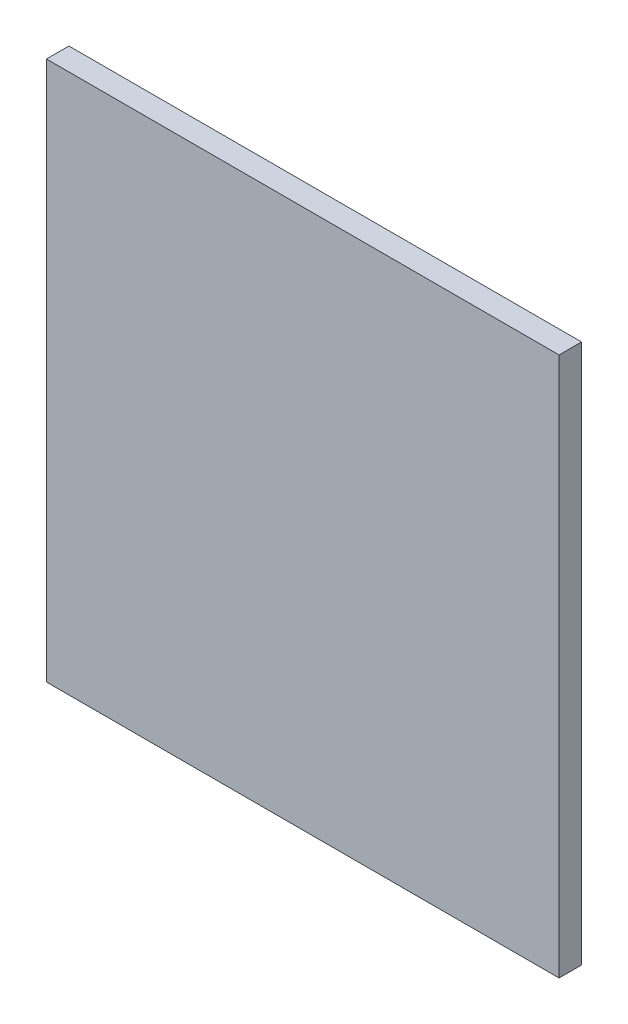
ISO-10303-21;
HEADER;
FILE_DESCRIPTION(('STEP AP214'),'2;1');
FILE_NAME('part.step','',(''),(''),'','','');
FILE_SCHEMA(('AUTOMOTIVE_DESIGN { 1 0 10303 214 1 1 1 1 }'));
ENDSEC;
DATA;
#1=APPLICATION_CONTEXT('core data for automotive mechanical design processes');
#2=APPLICATION_PROTOCOL_DEFINITION('international standard','automotive_design',2000,#1);
#3=PRODUCT_CONTEXT('',#1,'mechanical');
#4=PRODUCT('Part','Part','',(#3));
#5=PRODUCT_RELATED_PRODUCT_CATEGORY('part','',(#4));
#6=PRODUCT_DEFINITION_FORMATION('','',#4);
#7=PRODUCT_DEFINITION_CONTEXT('part definition',#1,'design');
#8=PRODUCT_DEFINITION('design','',#6,#7);
#9=PRODUCT_DEFINITION_SHAPE('','',#8);
#10=(LENGTH_UNIT() NAMED_UNIT(*) SI_UNIT(.MILLI.,.METRE.));
#11=(NAMED_UNIT(*) PLANE_ANGLE_UNIT() SI_UNIT($,.RADIAN.));
#12=(NAMED_UNIT(*) SI_UNIT($,.STERADIAN.) SOLID_ANGLE_UNIT());
#13=UNCERTAINTY_MEASURE_WITH_UNIT(LENGTH_MEASURE(1.E-05),#10,'distance_accuracy_value','');
#14=(GEOMETRIC_REPRESENTATION_CONTEXT(3) GLOBAL_UNCERTAINTY_ASSIGNED_CONTEXT((#13)) GLOBAL_UNIT_ASSIGNED_CONTEXT((#10,
#11,#12)) REPRESENTATION_CONTEXT('',''));
#15=CARTESIAN_POINT('',(0.,0.,0.));
#16=DIRECTION('',(0.,0.,1.));
#17=DIRECTION('',(1.,0.,0.));
#18=AXIS2_PLACEMENT_3D('',#15,#16,#17);
#19=CARTESIAN_POINT('',(0.,0.,3.175));
#20=DIRECTION('',(1.,0.,0.));
#21=DIRECTION('',(0.,0.,-1.));
#22=AXIS2_PLACEMENT_3D('',#19,#20,#21);
#23=PLANE('',#22);
#24=DIRECTION('',(0.,-1.,0.));
#25=VECTOR('',#24,1.);
#26=CARTESIAN_POINT('',(0.,0.,0.));
#27=LINE('',#26,#25);
#28=CARTESIAN_POINT('',(0.,76.2,0.));
#29=VERTEX_POINT('',#28);
#30=CARTESIAN_POINT('',(0.,0.,0.));
#31=VERTEX_POINT('',#30);
#32=EDGE_CURVE('E96',#29,#31,#27,.T.);
#33=ORIENTED_EDGE('',*,*,#32,.T.);
#34=DIRECTION('',(0.,0.,-1.));
#35=VECTOR('',#34,1.);
#36=CARTESIAN_POINT('',(0.,0.,3.175));
#37=LINE('',#36,#35);
#38=CARTESIAN_POINT('',(0.,0.,3.175));
#39=VERTEX_POINT('',#38);
#40=EDGE_CURVE('E11',#39,#31,#37,.T.);
#41=ORIENTED_EDGE('',*,*,#40,.F.);
#42=DIRECTION('',(0.,-1.,0.));
#43=VECTOR('',#42,1.);
#44=CARTESIAN_POINT('',(0.,0.,3.175));
#45=LINE('',#44,#43);
#46=CARTESIAN_POINT('',(0.,76.2,3.175));
#47=VERTEX_POINT('',#46);
#48=EDGE_CURVE('E84',#47,#39,#45,.T.);
#49=ORIENTED_EDGE('',*,*,#48,.F.);
#50=DIRECTION('',(0.,0.,-1.));
#51=VECTOR('',#50,1.);
#52=CARTESIAN_POINT('',(0.,76.2,3.175));
#53=LINE('',#52,#51);
#54=EDGE_CURVE('E92',#47,#29,#53,.T.);
#55=ORIENTED_EDGE('',*,*,#54,.T.);
#56=EDGE_LOOP('',(#33,#41,#49,#55));
#57=FACE_BOUND('',#56,.T.);
#58=ADVANCED_FACE('F33',(#57),#23,.F.);
#59=CARTESIAN_POINT('',(0.,0.,3.175));
#60=DIRECTION('',(0.,1.,0.));
#61=DIRECTION('',(0.,0.,1.));
#62=AXIS2_PLACEMENT_3D('',#59,#60,#61);
#63=PLANE('',#62);
#64=DIRECTION('',(1.,0.,0.));
#65=VECTOR('',#64,1.);
#66=CARTESIAN_POINT('',(0.,0.,0.));
#67=LINE('',#66,#65);
#68=CARTESIAN_POINT('',(72.39,0.,0.));
#69=VERTEX_POINT('',#68);
#70=EDGE_CURVE('E88',#31,#69,#67,.T.);
#71=ORIENTED_EDGE('',*,*,#70,.T.);
#72=DIRECTION('',(0.,0.,-1.));
#73=VECTOR('',#72,1.);
#74=CARTESIAN_POINT('',(72.39,0.,3.175));
#75=LINE('',#74,#73);
#76=CARTESIAN_POINT('',(72.39,0.,3.175));
#77=VERTEX_POINT('',#76);
#78=EDGE_CURVE('E41',#77,#69,#75,.T.);
#79=ORIENTED_EDGE('',*,*,#78,.F.);
#80=DIRECTION('',(1.,0.,0.));
#81=VECTOR('',#80,1.);
#82=CARTESIAN_POINT('',(0.,0.,3.175));
#83=LINE('',#82,#81);
#84=EDGE_CURVE('E79',#39,#77,#83,.T.);
#85=ORIENTED_EDGE('',*,*,#84,.F.);
#86=ORIENTED_EDGE('',*,*,#40,.T.);
#87=EDGE_LOOP('',(#71,#79,#85,#86));
#88=FACE_BOUND('',#87,.T.);
#89=ADVANCED_FACE('F87',(#88),#63,.F.);
#90=CARTESIAN_POINT('',(72.39,0.,3.175));
#91=DIRECTION('',(-1.,0.,0.));
#92=DIRECTION('',(0.,0.,1.));
#93=AXIS2_PLACEMENT_3D('',#90,#91,#92);
#94=PLANE('',#93);
#95=DIRECTION('',(0.,1.,0.));
#96=VECTOR('',#95,1.);
#97=CARTESIAN_POINT('',(72.39,0.,0.));
#98=LINE('',#97,#96);
#99=CARTESIAN_POINT('',(72.39,76.2,0.));
#100=VERTEX_POINT('',#99);
#101=EDGE_CURVE('E66',#69,#100,#98,.T.);
#102=ORIENTED_EDGE('',*,*,#101,.T.);
#103=DIRECTION('',(0.,0.,-1.));
#104=VECTOR('',#103,1.);
#105=CARTESIAN_POINT('',(72.39,76.2,3.175));
#106=LINE('',#105,#104);
#107=CARTESIAN_POINT('',(72.39,76.2,3.175));
#108=VERTEX_POINT('',#107);
#109=EDGE_CURVE('E89',#108,#100,#106,.T.);
#110=ORIENTED_EDGE('',*,*,#109,.F.);
#111=DIRECTION('',(0.,1.,0.));
#112=VECTOR('',#111,1.);
#113=CARTESIAN_POINT('',(72.39,0.,3.175));
#114=LINE('',#113,#112);
#115=EDGE_CURVE('E82',#77,#108,#114,.T.);
#116=ORIENTED_EDGE('',*,*,#115,.F.);
#117=ORIENTED_EDGE('',*,*,#78,.T.);
#118=EDGE_LOOP('',(#102,#110,#116,#117));
#119=FACE_BOUND('',#118,.T.);
#120=ADVANCED_FACE('F90',(#119),#94,.F.);
#121=CARTESIAN_POINT('',(0.,76.2,3.175));
#122=DIRECTION('',(0.,-1.,0.));
#123=DIRECTION('',(0.,0.,-1.));
#124=AXIS2_PLACEMENT_3D('',#121,#122,#123);
#125=PLANE('',#124);
#126=DIRECTION('',(-1.,0.,0.));
#127=VECTOR('',#126,1.);
#128=CARTESIAN_POINT('',(0.,76.2,0.));
#129=LINE('',#128,#127);
#130=EDGE_CURVE('E72',#100,#29,#129,.T.);
#131=ORIENTED_EDGE('',*,*,#130,.T.);
#132=ORIENTED_EDGE('',*,*,#54,.F.);
#133=DIRECTION('',(-1.,0.,0.));
#134=VECTOR('',#133,1.);
#135=CARTESIAN_POINT('',(0.,76.2,3.175));
#136=LINE('',#135,#134);
#137=EDGE_CURVE('E49',#108,#47,#136,.T.);
#138=ORIENTED_EDGE('',*,*,#137,.F.);
#139=ORIENTED_EDGE('',*,*,#109,.T.);
#140=EDGE_LOOP('',(#131,#132,#138,#139));
#141=FACE_BOUND('',#140,.T.);
#142=ADVANCED_FACE('F103',(#141),#125,.F.);
#143=CARTESIAN_POINT('',(0.,0.,3.175));
#144=DIRECTION('',(0.,0.,-1.));
#145=DIRECTION('',(-1.,0.,0.));
#146=AXIS2_PLACEMENT_3D('',#143,#144,#145);
#147=PLANE('',#146);
#148=ORIENTED_EDGE('',*,*,#48,.T.);
#149=ORIENTED_EDGE('',*,*,#84,.T.);
#150=ORIENTED_EDGE('',*,*,#115,.T.);
#151=ORIENTED_EDGE('',*,*,#137,.T.);
#152=EDGE_LOOP('',(#148,#149,#150,#151));
#153=FACE_BOUND('',#152,.T.);
#154=ADVANCED_FACE('F80',(#153),#147,.F.);
#155=CARTESIAN_POINT('',(0.,0.,0.));
#156=DIRECTION('',(0.,0.,-1.));
#157=DIRECTION('',(-1.,0.,0.));
#158=AXIS2_PLACEMENT_3D('',#155,#156,#157);
#159=PLANE('',#158);
#160=ORIENTED_EDGE('',*,*,#32,.F.);
#161=ORIENTED_EDGE('',*,*,#130,.F.);
#162=ORIENTED_EDGE('',*,*,#101,.F.);
#163=ORIENTED_EDGE('',*,*,#70,.F.);
#164=EDGE_LOOP('',(#160,#161,#162,#163));
#165=FACE_BOUND('',#164,.T.);
#166=ADVANCED_FACE('F106',(#165),#159,.T.);
#167=CLOSED_SHELL('',(#58,#89,#120,#142,#154,#166));
#168=MANIFOLD_SOLID_BREP('B2',#167);
#169=ADVANCED_BREP_SHAPE_REPRESENTATION('',(#18,#168),#14);
#170=SHAPE_DEFINITION_REPRESENTATION(#9,#169);
ENDSEC;
END-ISO-10303-21;
